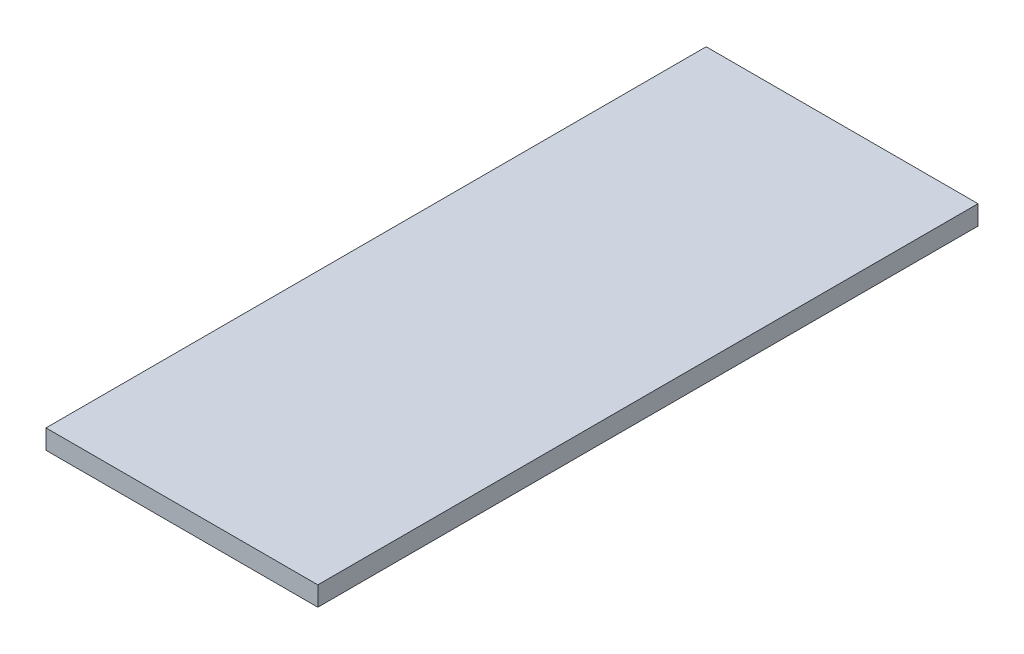
ISO-10303-21;
HEADER;
FILE_DESCRIPTION(('STEP AP214'),'2;1');
FILE_NAME('part.step','',(''),(''),'','','');
FILE_SCHEMA(('AUTOMOTIVE_DESIGN { 1 0 10303 214 1 1 1 1 }'));
ENDSEC;
DATA;
#1=APPLICATION_CONTEXT('core data for automotive mechanical design processes');
#2=APPLICATION_PROTOCOL_DEFINITION('international standard','automotive_design',2000,#1);
#3=PRODUCT_CONTEXT('',#1,'mechanical');
#4=PRODUCT('Part','Part','',(#3));
#5=PRODUCT_RELATED_PRODUCT_CATEGORY('part','',(#4));
#6=PRODUCT_DEFINITION_FORMATION('','',#4);
#7=PRODUCT_DEFINITION_CONTEXT('part definition',#1,'design');
#8=PRODUCT_DEFINITION('design','',#6,#7);
#9=PRODUCT_DEFINITION_SHAPE('','',#8);
#10=(LENGTH_UNIT() NAMED_UNIT(*) SI_UNIT(.MILLI.,.METRE.));
#11=(NAMED_UNIT(*) PLANE_ANGLE_UNIT() SI_UNIT($,.RADIAN.));
#12=(NAMED_UNIT(*) SI_UNIT($,.STERADIAN.) SOLID_ANGLE_UNIT());
#13=UNCERTAINTY_MEASURE_WITH_UNIT(LENGTH_MEASURE(1.E-05),#10,'distance_accuracy_value','');
#14=(GEOMETRIC_REPRESENTATION_CONTEXT(3) GLOBAL_UNCERTAINTY_ASSIGNED_CONTEXT((#13)) GLOBAL_UNIT_ASSIGNED_CONTEXT((#10,
#11,#12)) REPRESENTATION_CONTEXT('',''));
#15=CARTESIAN_POINT('',(0.,0.,0.));
#16=DIRECTION('',(0.,0.,1.));
#17=DIRECTION('',(1.,0.,0.));
#18=AXIS2_PLACEMENT_3D('',#15,#16,#17);
#19=CARTESIAN_POINT('',(-0.425,0.05,-1.425));
#20=DIRECTION('',(-0.707106781186548,0.,-0.707106781186548));
#21=DIRECTION('',(-0.707106781186548,0.,0.707106781186548));
#22=AXIS2_PLACEMENT_3D('',#19,#20,#21);
#23=PLANE('',#22);
#24=DIRECTION('',(-0.707106781186548,0.,0.707106781186548));
#25=VECTOR('',#24,1.);
#26=CARTESIAN_POINT('',(-0.25,0.1,-1.6));
#27=LINE('',#26,#25);
#28=CARTESIAN_POINT('',(-0.25,0.1,-1.6));
#29=VERTEX_POINT('',#28);
#30=CARTESIAN_POINT('',(-0.6,0.1,-1.25));
#31=VERTEX_POINT('',#30);
#32=EDGE_CURVE('E11',#29,#31,#27,.T.);
#33=ORIENTED_EDGE('',*,*,#32,.F.);
#34=DIRECTION('',(0.,1.,0.));
#35=VECTOR('',#34,1.);
#36=CARTESIAN_POINT('',(-0.25,0.,-1.6));
#37=LINE('',#36,#35);
#38=CARTESIAN_POINT('',(-0.25,0.,-1.6));
#39=VERTEX_POINT('',#38);
#40=EDGE_CURVE('E25',#39,#29,#37,.T.);
#41=ORIENTED_EDGE('',*,*,#40,.F.);
#42=DIRECTION('',(0.707106781186548,0.,-0.707106781186548));
#43=VECTOR('',#42,1.);
#44=CARTESIAN_POINT('',(-0.6,0.,-1.25));
#45=LINE('',#44,#43);
#46=CARTESIAN_POINT('',(-0.6,0.,-1.25));
#47=VERTEX_POINT('',#46);
#48=EDGE_CURVE('E206',#47,#39,#45,.T.);
#49=ORIENTED_EDGE('',*,*,#48,.F.);
#50=DIRECTION('',(0.,1.,0.));
#51=VECTOR('',#50,1.);
#52=CARTESIAN_POINT('',(-0.6,0.,-1.25));
#53=LINE('',#52,#51);
#54=EDGE_CURVE('E202',#47,#31,#53,.T.);
#55=ORIENTED_EDGE('',*,*,#54,.T.);
#56=EDGE_LOOP('',(#33,#41,#49,#55));
#57=FACE_BOUND('',#56,.T.);
#58=ADVANCED_FACE('F17',(#57),#23,.T.);
#59=CARTESIAN_POINT('',(-0.6,0.1,1.6));
#60=DIRECTION('',(-1.,0.,0.));
#61=DIRECTION('',(0.,0.,-1.));
#62=AXIS2_PLACEMENT_3D('',#59,#60,#61);
#63=PLANE('',#62);
#64=DIRECTION('',(0.,0.,-1.));
#65=VECTOR('',#64,1.);
#66=CARTESIAN_POINT('',(-0.6,0.,1.6));
#67=LINE('',#66,#65);
#68=CARTESIAN_POINT('',(-0.6,0.,1.6));
#69=VERTEX_POINT('',#68);
#70=EDGE_CURVE('E197',#69,#47,#67,.T.);
#71=ORIENTED_EDGE('',*,*,#70,.F.);
#72=DIRECTION('',(0.,-1.,0.));
#73=VECTOR('',#72,1.);
#74=CARTESIAN_POINT('',(-0.6,0.1,1.6));
#75=LINE('',#74,#73);
#76=CARTESIAN_POINT('',(-0.6,0.1,1.6));
#77=VERTEX_POINT('',#76);
#78=EDGE_CURVE('E192',#77,#69,#75,.T.);
#79=ORIENTED_EDGE('',*,*,#78,.F.);
#80=DIRECTION('',(0.,0.,-1.));
#81=VECTOR('',#80,1.);
#82=CARTESIAN_POINT('',(-0.6,0.1,1.6));
#83=LINE('',#82,#81);
#84=EDGE_CURVE('E187',#77,#31,#83,.T.);
#85=ORIENTED_EDGE('',*,*,#84,.T.);
#86=ORIENTED_EDGE('',*,*,#54,.F.);
#87=EDGE_LOOP('',(#71,#79,#85,#86));
#88=FACE_BOUND('',#87,.T.);
#89=ADVANCED_FACE('F224',(#88),#63,.T.);
#90=CARTESIAN_POINT('',(0.,0.1,0.));
#91=DIRECTION('',(0.,1.,0.));
#92=DIRECTION('',(1.,0.,0.));
#93=AXIS2_PLACEMENT_3D('',#90,#91,#92);
#94=PLANE('',#93);
#95=DIRECTION('',(-1.,0.,0.));
#96=VECTOR('',#95,1.);
#97=CARTESIAN_POINT('',(0.7,0.1,-1.7));
#98=LINE('',#97,#96);
#99=CARTESIAN_POINT('',(0.7,0.1,-1.7));
#100=VERTEX_POINT('',#99);
#101=CARTESIAN_POINT('',(-0.7,0.1,-1.7));
#102=VERTEX_POINT('',#101);
#103=EDGE_CURVE('E182',#100,#102,#98,.T.);
#104=ORIENTED_EDGE('',*,*,#103,.F.);
#105=DIRECTION('',(0.,0.,-1.));
#106=VECTOR('',#105,1.);
#107=CARTESIAN_POINT('',(0.7,0.1,1.7));
#108=LINE('',#107,#106);
#109=CARTESIAN_POINT('',(0.7,0.1,1.7));
#110=VERTEX_POINT('',#109);
#111=EDGE_CURVE('E178',#110,#100,#108,.T.);
#112=ORIENTED_EDGE('',*,*,#111,.F.);
#113=DIRECTION('',(1.,0.,0.));
#114=VECTOR('',#113,1.);
#115=CARTESIAN_POINT('',(-0.7,0.1,1.7));
#116=LINE('',#115,#114);
#117=CARTESIAN_POINT('',(-0.7,0.1,1.7));
#118=VERTEX_POINT('',#117);
#119=EDGE_CURVE('E106',#118,#110,#116,.T.);
#120=ORIENTED_EDGE('',*,*,#119,.F.);
#121=DIRECTION('',(0.,0.,1.));
#122=VECTOR('',#121,1.);
#123=CARTESIAN_POINT('',(-0.7,0.1,-1.7));
#124=LINE('',#123,#122);
#125=EDGE_CURVE('E170',#102,#118,#124,.T.);
#126=ORIENTED_EDGE('',*,*,#125,.F.);
#127=EDGE_LOOP('',(#104,#112,#120,#126));
#128=FACE_BOUND('',#127,.T.);
#129=DIRECTION('',(-1.,0.,0.));
#130=VECTOR('',#129,1.);
#131=CARTESIAN_POINT('',(0.6,0.1,1.6));
#132=LINE('',#131,#130);
#133=CARTESIAN_POINT('',(0.6,0.1,1.6));
#134=VERTEX_POINT('',#133);
#135=EDGE_CURVE('E165',#134,#77,#132,.T.);
#136=ORIENTED_EDGE('',*,*,#135,.F.);
#137=DIRECTION('',(0.,0.,1.));
#138=VECTOR('',#137,1.);
#139=CARTESIAN_POINT('',(0.6,0.1,-1.6));
#140=LINE('',#139,#138);
#141=CARTESIAN_POINT('',(0.6,0.1,-1.6));
#142=VERTEX_POINT('',#141);
#143=EDGE_CURVE('E160',#142,#134,#140,.T.);
#144=ORIENTED_EDGE('',*,*,#143,.F.);
#145=DIRECTION('',(1.,0.,0.));
#146=VECTOR('',#145,1.);
#147=CARTESIAN_POINT('',(-0.25,0.1,-1.6));
#148=LINE('',#147,#146);
#149=EDGE_CURVE('E155',#29,#142,#148,.T.);
#150=ORIENTED_EDGE('',*,*,#149,.F.);
#151=ORIENTED_EDGE('',*,*,#32,.T.);
#152=ORIENTED_EDGE('',*,*,#84,.F.);
#153=EDGE_LOOP('',(#136,#144,#150,#151,#152));
#154=FACE_BOUND('',#153,.T.);
#155=ADVANCED_FACE('F226',(#128,#154),#94,.F.);
#156=CARTESIAN_POINT('',(-0.6,0.1,-1.6));
#157=DIRECTION('',(0.,0.,-1.));
#158=DIRECTION('',(1.,0.,0.));
#159=AXIS2_PLACEMENT_3D('',#156,#157,#158);
#160=PLANE('',#159);
#161=ORIENTED_EDGE('',*,*,#149,.T.);
#162=DIRECTION('',(0.,-1.,0.));
#163=VECTOR('',#162,1.);
#164=CARTESIAN_POINT('',(0.6,0.1,-1.6));
#165=LINE('',#164,#163);
#166=CARTESIAN_POINT('',(0.6,0.,-1.6));
#167=VERTEX_POINT('',#166);
#168=EDGE_CURVE('E151',#142,#167,#165,.T.);
#169=ORIENTED_EDGE('',*,*,#168,.T.);
#170=DIRECTION('',(1.,0.,0.));
#171=VECTOR('',#170,1.);
#172=CARTESIAN_POINT('',(-0.25,0.,-1.6));
#173=LINE('',#172,#171);
#174=EDGE_CURVE('E146',#39,#167,#173,.T.);
#175=ORIENTED_EDGE('',*,*,#174,.F.);
#176=ORIENTED_EDGE('',*,*,#40,.T.);
#177=EDGE_LOOP('',(#161,#169,#175,#176));
#178=FACE_BOUND('',#177,.T.);
#179=ADVANCED_FACE('F216',(#178),#160,.T.);
#180=CARTESIAN_POINT('',(0.,0.,0.));
#181=DIRECTION('',(0.,-1.,0.));
#182=DIRECTION('',(-1.,0.,0.));
#183=AXIS2_PLACEMENT_3D('',#180,#181,#182);
#184=PLANE('',#183);
#185=ORIENTED_EDGE('',*,*,#174,.T.);
#186=DIRECTION('',(0.,0.,1.));
#187=VECTOR('',#186,1.);
#188=CARTESIAN_POINT('',(0.6,0.,-1.6));
#189=LINE('',#188,#187);
#190=CARTESIAN_POINT('',(0.6,0.,1.6));
#191=VERTEX_POINT('',#190);
#192=EDGE_CURVE('E142',#167,#191,#189,.T.);
#193=ORIENTED_EDGE('',*,*,#192,.T.);
#194=DIRECTION('',(-1.,0.,0.));
#195=VECTOR('',#194,1.);
#196=CARTESIAN_POINT('',(0.6,0.,1.6));
#197=LINE('',#196,#195);
#198=EDGE_CURVE('E137',#191,#69,#197,.T.);
#199=ORIENTED_EDGE('',*,*,#198,.T.);
#200=ORIENTED_EDGE('',*,*,#70,.T.);
#201=ORIENTED_EDGE('',*,*,#48,.T.);
#202=EDGE_LOOP('',(#185,#193,#199,#200,#201));
#203=FACE_BOUND('',#202,.T.);
#204=ADVANCED_FACE('F220',(#203),#184,.T.);
#205=CARTESIAN_POINT('',(0.6,0.1,1.6));
#206=DIRECTION('',(0.,0.,1.));
#207=DIRECTION('',(-1.,0.,0.));
#208=AXIS2_PLACEMENT_3D('',#205,#206,#207);
#209=PLANE('',#208);
#210=ORIENTED_EDGE('',*,*,#78,.T.);
#211=ORIENTED_EDGE('',*,*,#198,.F.);
#212=DIRECTION('',(0.,-1.,0.));
#213=VECTOR('',#212,1.);
#214=CARTESIAN_POINT('',(0.6,0.1,1.6));
#215=LINE('',#214,#213);
#216=EDGE_CURVE('E132',#134,#191,#215,.T.);
#217=ORIENTED_EDGE('',*,*,#216,.F.);
#218=ORIENTED_EDGE('',*,*,#135,.T.);
#219=EDGE_LOOP('',(#210,#211,#217,#218));
#220=FACE_BOUND('',#219,.T.);
#221=ADVANCED_FACE('F232',(#220),#209,.T.);
#222=CARTESIAN_POINT('',(0.6,0.1,-1.6));
#223=DIRECTION('',(1.,0.,0.));
#224=DIRECTION('',(0.,0.,1.));
#225=AXIS2_PLACEMENT_3D('',#222,#223,#224);
#226=PLANE('',#225);
#227=ORIENTED_EDGE('',*,*,#216,.T.);
#228=ORIENTED_EDGE('',*,*,#192,.F.);
#229=ORIENTED_EDGE('',*,*,#168,.F.);
#230=ORIENTED_EDGE('',*,*,#143,.T.);
#231=EDGE_LOOP('',(#227,#228,#229,#230));
#232=FACE_BOUND('',#231,.T.);
#233=ADVANCED_FACE('F229',(#232),#226,.T.);
#234=CARTESIAN_POINT('',(-0.7,0.1,-1.7));
#235=DIRECTION('',(-1.,0.,0.));
#236=DIRECTION('',(0.,0.,1.));
#237=AXIS2_PLACEMENT_3D('',#234,#235,#236);
#238=PLANE('',#237);
#239=DIRECTION('',(0.,1.,0.));
#240=VECTOR('',#239,1.);
#241=CARTESIAN_POINT('',(-0.7,0.1,1.7));
#242=LINE('',#241,#240);
#243=CARTESIAN_POINT('',(-0.7,0.2,1.7));
#244=VERTEX_POINT('',#243);
#245=EDGE_CURVE('E128',#118,#244,#242,.T.);
#246=ORIENTED_EDGE('',*,*,#245,.T.);
#247=DIRECTION('',(0.,0.,1.));
#248=VECTOR('',#247,1.);
#249=CARTESIAN_POINT('',(-0.7,0.2,-1.7));
#250=LINE('',#249,#248);
#251=CARTESIAN_POINT('',(-0.7,0.2,-1.7));
#252=VERTEX_POINT('',#251);
#253=EDGE_CURVE('E101',#252,#244,#250,.T.);
#254=ORIENTED_EDGE('',*,*,#253,.F.);
#255=DIRECTION('',(0.,1.,0.));
#256=VECTOR('',#255,1.);
#257=CARTESIAN_POINT('',(-0.7,0.1,-1.7));
#258=LINE('',#257,#256);
#259=EDGE_CURVE('E120',#102,#252,#258,.T.);
#260=ORIENTED_EDGE('',*,*,#259,.F.);
#261=ORIENTED_EDGE('',*,*,#125,.T.);
#262=EDGE_LOOP('',(#246,#254,#260,#261));
#263=FACE_BOUND('',#262,.T.);
#264=ADVANCED_FACE('F240',(#263),#238,.T.);
#265=CARTESIAN_POINT('',(0.7,0.1,-1.7));
#266=DIRECTION('',(0.,0.,-1.));
#267=DIRECTION('',(-1.,0.,0.));
#268=AXIS2_PLACEMENT_3D('',#265,#266,#267);
#269=PLANE('',#268);
#270=ORIENTED_EDGE('',*,*,#259,.T.);
#271=DIRECTION('',(-1.,0.,0.));
#272=VECTOR('',#271,1.);
#273=CARTESIAN_POINT('',(0.7,0.2,-1.7));
#274=LINE('',#273,#272);
#275=CARTESIAN_POINT('',(0.7,0.2,-1.7));
#276=VERTEX_POINT('',#275);
#277=EDGE_CURVE('E116',#276,#252,#274,.T.);
#278=ORIENTED_EDGE('',*,*,#277,.F.);
#279=DIRECTION('',(0.,1.,0.));
#280=VECTOR('',#279,1.);
#281=CARTESIAN_POINT('',(0.7,0.1,-1.7));
#282=LINE('',#281,#280);
#283=EDGE_CURVE('E93',#100,#276,#282,.T.);
#284=ORIENTED_EDGE('',*,*,#283,.F.);
#285=ORIENTED_EDGE('',*,*,#103,.T.);
#286=EDGE_LOOP('',(#270,#278,#284,#285));
#287=FACE_BOUND('',#286,.T.);
#288=ADVANCED_FACE('F291',(#287),#269,.T.);
#289=CARTESIAN_POINT('',(0.7,0.1,1.7));
#290=DIRECTION('',(1.,0.,0.));
#291=DIRECTION('',(0.,0.,-1.));
#292=AXIS2_PLACEMENT_3D('',#289,#290,#291);
#293=PLANE('',#292);
#294=ORIENTED_EDGE('',*,*,#283,.T.);
#295=DIRECTION('',(0.,0.,-1.));
#296=VECTOR('',#295,1.);
#297=CARTESIAN_POINT('',(0.7,0.2,1.7));
#298=LINE('',#297,#296);
#299=CARTESIAN_POINT('',(0.7,0.2,1.7));
#300=VERTEX_POINT('',#299);
#301=EDGE_CURVE('E85',#300,#276,#298,.T.);
#302=ORIENTED_EDGE('',*,*,#301,.F.);
#303=DIRECTION('',(0.,1.,0.));
#304=VECTOR('',#303,1.);
#305=CARTESIAN_POINT('',(0.7,0.1,1.7));
#306=LINE('',#305,#304);
#307=EDGE_CURVE('E90',#110,#300,#306,.T.);
#308=ORIENTED_EDGE('',*,*,#307,.F.);
#309=ORIENTED_EDGE('',*,*,#111,.T.);
#310=EDGE_LOOP('',(#294,#302,#308,#309));
#311=FACE_BOUND('',#310,.T.);
#312=ADVANCED_FACE('F87',(#311),#293,.T.);
#313=CARTESIAN_POINT('',(-0.7,0.1,1.7));
#314=DIRECTION('',(0.,0.,1.));
#315=DIRECTION('',(1.,0.,0.));
#316=AXIS2_PLACEMENT_3D('',#313,#314,#315);
#317=PLANE('',#316);
#318=ORIENTED_EDGE('',*,*,#307,.T.);
#319=DIRECTION('',(1.,0.,0.));
#320=VECTOR('',#319,1.);
#321=CARTESIAN_POINT('',(-0.7,0.2,1.7));
#322=LINE('',#321,#320);
#323=EDGE_CURVE('E99',#244,#300,#322,.T.);
#324=ORIENTED_EDGE('',*,*,#323,.F.);
#325=ORIENTED_EDGE('',*,*,#245,.F.);
#326=ORIENTED_EDGE('',*,*,#119,.T.);
#327=EDGE_LOOP('',(#318,#324,#325,#326));
#328=FACE_BOUND('',#327,.T.);
#329=ADVANCED_FACE('F105',(#328),#317,.T.);
#330=CARTESIAN_POINT('',(0.,0.2,0.));
#331=DIRECTION('',(0.,1.,0.));
#332=DIRECTION('',(1.,0.,0.));
#333=AXIS2_PLACEMENT_3D('',#330,#331,#332);
#334=PLANE('',#333);
#335=ORIENTED_EDGE('',*,*,#323,.T.);
#336=ORIENTED_EDGE('',*,*,#301,.T.);
#337=ORIENTED_EDGE('',*,*,#277,.T.);
#338=ORIENTED_EDGE('',*,*,#253,.T.);
#339=EDGE_LOOP('',(#335,#336,#337,#338));
#340=FACE_BOUND('',#339,.T.);
#341=ADVANCED_FACE('F100',(#340),#334,.T.);
#342=CLOSED_SHELL('',(#58,#89,#155,#179,#204,#221,#233,#264,#288,#312,#329,#341));
#343=MANIFOLD_SOLID_BREP('B1',#342);
#344=ADVANCED_BREP_SHAPE_REPRESENTATION('',(#18,#343),#14);
#345=SHAPE_DEFINITION_REPRESENTATION(#9,#344);
ENDSEC;
END-ISO-10303-21;
